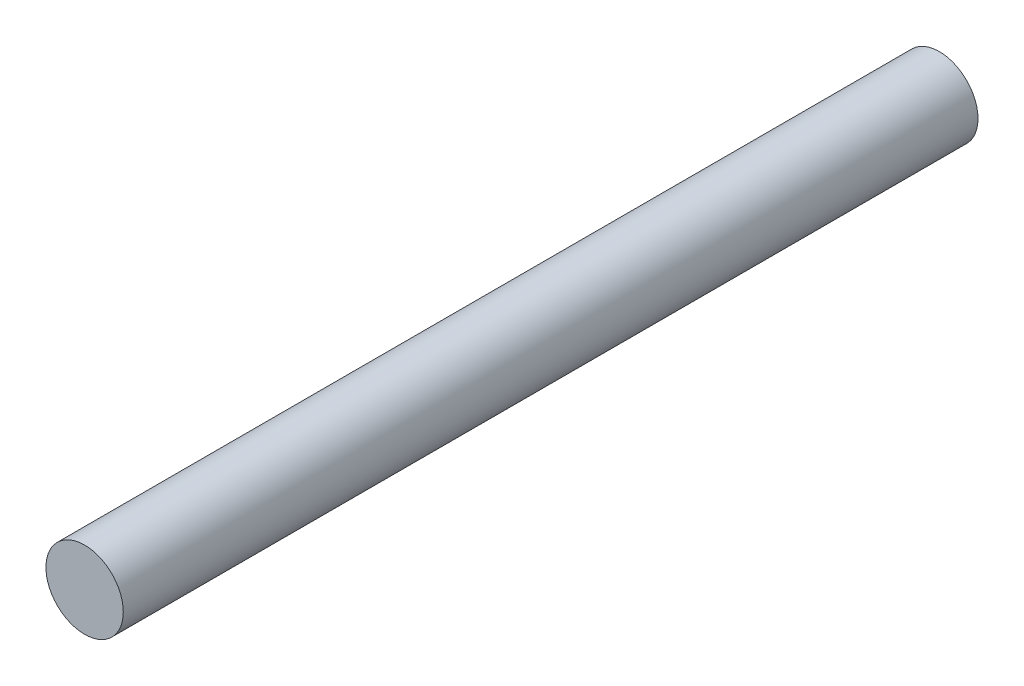
ISO-10303-21;
HEADER;
FILE_DESCRIPTION(('STEP AP214'),'2;1');
FILE_NAME('part.step','',(''),(''),'','','');
FILE_SCHEMA(('AUTOMOTIVE_DESIGN { 1 0 10303 214 1 1 1 1 }'));
ENDSEC;
DATA;
#1=APPLICATION_CONTEXT('core data for automotive mechanical design processes');
#2=APPLICATION_PROTOCOL_DEFINITION('international standard','automotive_design',2000,#1);
#3=PRODUCT_CONTEXT('',#1,'mechanical');
#4=PRODUCT('Part','Part','',(#3));
#5=PRODUCT_RELATED_PRODUCT_CATEGORY('part','',(#4));
#6=PRODUCT_DEFINITION_FORMATION('','',#4);
#7=PRODUCT_DEFINITION_CONTEXT('part definition',#1,'design');
#8=PRODUCT_DEFINITION('design','',#6,#7);
#9=PRODUCT_DEFINITION_SHAPE('','',#8);
#10=(LENGTH_UNIT() NAMED_UNIT(*) SI_UNIT(.MILLI.,.METRE.));
#11=(NAMED_UNIT(*) PLANE_ANGLE_UNIT() SI_UNIT($,.RADIAN.));
#12=(NAMED_UNIT(*) SI_UNIT($,.STERADIAN.) SOLID_ANGLE_UNIT());
#13=UNCERTAINTY_MEASURE_WITH_UNIT(LENGTH_MEASURE(1.E-05),#10,'distance_accuracy_value','');
#14=(GEOMETRIC_REPRESENTATION_CONTEXT(3) GLOBAL_UNCERTAINTY_ASSIGNED_CONTEXT((#13)) GLOBAL_UNIT_ASSIGNED_CONTEXT((#10,
#11,#12)) REPRESENTATION_CONTEXT('',''));
#15=CARTESIAN_POINT('',(0.,0.,0.));
#16=DIRECTION('',(0.,0.,1.));
#17=DIRECTION('',(1.,0.,0.));
#18=AXIS2_PLACEMENT_3D('',#15,#16,#17);
#19=CARTESIAN_POINT('',(0.,0.,66.3));
#20=DIRECTION('',(0.,0.,-1.));
#21=DIRECTION('',(-1.,0.,0.));
#22=AXIS2_PLACEMENT_3D('',#19,#20,#21);
#23=CYLINDRICAL_SURFACE('',#22,3.);
#24=CARTESIAN_POINT('',(0.,0.,66.3));
#25=DIRECTION('',(0.,0.,1.));
#26=DIRECTION('',(1.,0.,0.));
#27=AXIS2_PLACEMENT_3D('',#24,#25,#26);
#28=CIRCLE('',#27,3.);
#29=CARTESIAN_POINT('',(3.,0.,66.3));
#30=VERTEX_POINT('',#29);
#31=EDGE_CURVE('E10',#30,#30,#28,.T.);
#32=ORIENTED_EDGE('',*,*,#31,.F.);
#33=EDGE_LOOP('',(#32));
#34=FACE_BOUND('',#33,.T.);
#35=CARTESIAN_POINT('',(0.,0.,0.));
#36=DIRECTION('',(0.,0.,1.));
#37=DIRECTION('',(1.,0.,0.));
#38=AXIS2_PLACEMENT_3D('',#35,#36,#37);
#39=CIRCLE('',#38,3.);
#40=CARTESIAN_POINT('',(3.,0.,0.));
#41=VERTEX_POINT('',#40);
#42=EDGE_CURVE('E40',#41,#41,#39,.T.);
#43=ORIENTED_EDGE('',*,*,#42,.T.);
#44=EDGE_LOOP('',(#43));
#45=FACE_BOUND('',#44,.T.);
#46=ADVANCED_FACE('F37',(#34,#45),#23,.T.);
#47=CARTESIAN_POINT('',(0.,0.,66.3));
#48=DIRECTION('',(0.,0.,1.));
#49=DIRECTION('',(1.,0.,0.));
#50=AXIS2_PLACEMENT_3D('',#47,#48,#49);
#51=PLANE('',#50);
#52=ORIENTED_EDGE('',*,*,#31,.T.);
#53=EDGE_LOOP('',(#52));
#54=FACE_BOUND('',#53,.T.);
#55=ADVANCED_FACE('F54',(#54),#51,.T.);
#56=CARTESIAN_POINT('',(0.,0.,0.));
#57=DIRECTION('',(0.,0.,1.));
#58=DIRECTION('',(1.,0.,0.));
#59=AXIS2_PLACEMENT_3D('',#56,#57,#58);
#60=PLANE('',#59);
#61=ORIENTED_EDGE('',*,*,#42,.F.);
#62=EDGE_LOOP('',(#61));
#63=FACE_BOUND('',#62,.T.);
#64=ADVANCED_FACE('F52',(#63),#60,.F.);
#65=CLOSED_SHELL('',(#46,#55,#64));
#66=MANIFOLD_SOLID_BREP('B2',#65);
#67=ADVANCED_BREP_SHAPE_REPRESENTATION('',(#18,#66),#14);
#68=SHAPE_DEFINITION_REPRESENTATION(#9,#67);
ENDSEC;
END-ISO-10303-21;
